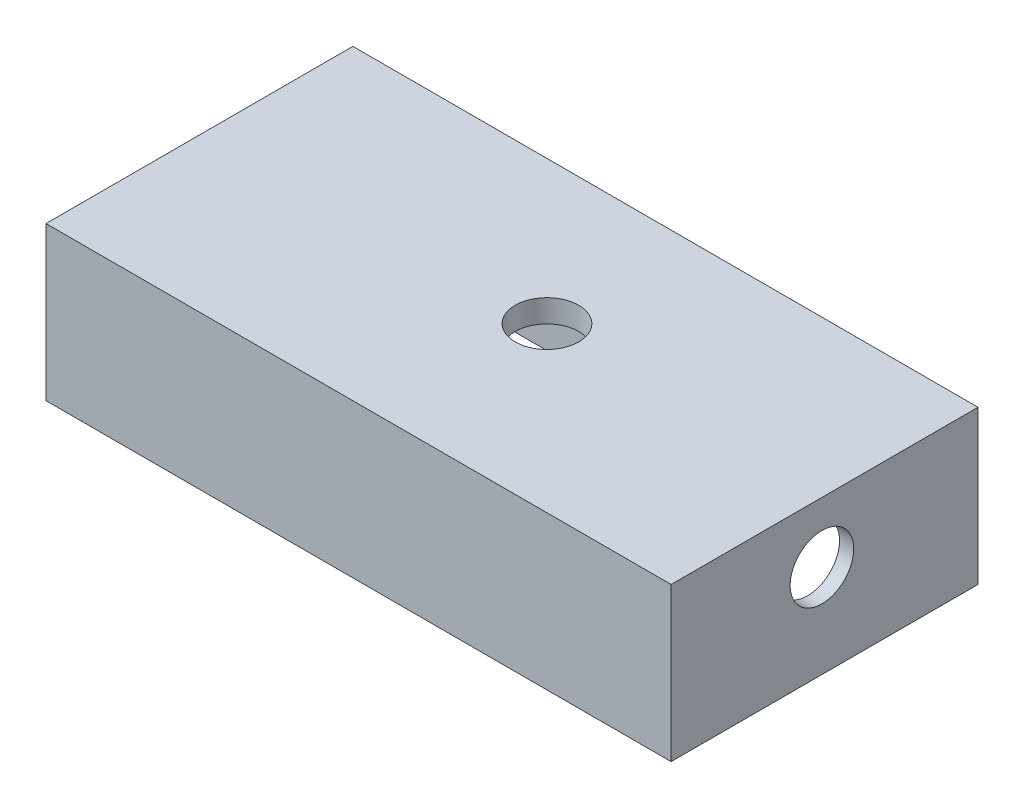
ISO-10303-21;
HEADER;
FILE_DESCRIPTION(('STEP AP214'),'2;1');
FILE_NAME('part.step','',(''),(''),'','','');
FILE_SCHEMA(('AUTOMOTIVE_DESIGN { 1 0 10303 214 1 1 1 1 }'));
ENDSEC;
DATA;
#1=APPLICATION_CONTEXT('core data for automotive mechanical design processes');
#2=APPLICATION_PROTOCOL_DEFINITION('international standard','automotive_design',2000,#1);
#3=PRODUCT_CONTEXT('',#1,'mechanical');
#4=PRODUCT('Part','Part','',(#3));
#5=PRODUCT_RELATED_PRODUCT_CATEGORY('part','',(#4));
#6=PRODUCT_DEFINITION_FORMATION('','',#4);
#7=PRODUCT_DEFINITION_CONTEXT('part definition',#1,'design');
#8=PRODUCT_DEFINITION('design','',#6,#7);
#9=PRODUCT_DEFINITION_SHAPE('','',#8);
#10=(LENGTH_UNIT() NAMED_UNIT(*) SI_UNIT(.MILLI.,.METRE.));
#11=(NAMED_UNIT(*) PLANE_ANGLE_UNIT() SI_UNIT($,.RADIAN.));
#12=(NAMED_UNIT(*) SI_UNIT($,.STERADIAN.) SOLID_ANGLE_UNIT());
#13=UNCERTAINTY_MEASURE_WITH_UNIT(LENGTH_MEASURE(1.E-05),#10,'distance_accuracy_value','');
#14=(GEOMETRIC_REPRESENTATION_CONTEXT(3) GLOBAL_UNCERTAINTY_ASSIGNED_CONTEXT((#13)) GLOBAL_UNIT_ASSIGNED_CONTEXT((#10,
#11,#12)) REPRESENTATION_CONTEXT('',''));
#15=CARTESIAN_POINT('',(0.,0.,0.));
#16=DIRECTION('',(0.,0.,1.));
#17=DIRECTION('',(1.,0.,0.));
#18=AXIS2_PLACEMENT_3D('',#15,#16,#17);
#19=CARTESIAN_POINT('',(174.625,85.725,85.725));
#20=DIRECTION('',(-1.,0.,0.));
#21=DIRECTION('',(0.,0.,1.));
#22=AXIS2_PLACEMENT_3D('',#19,#20,#21);
#23=PLANE('',#22);
#24=CARTESIAN_POINT('',(174.625,51.9726422641524,1.47611621049332));
#25=DIRECTION('',(1.,0.,0.));
#26=DIRECTION('',(0.,0.,-1.));
#27=AXIS2_PLACEMENT_3D('',#24,#25,#26);
#28=CIRCLE('',#27,17.7497380315211);
#29=CARTESIAN_POINT('',(174.625,51.9726422641524,-16.2736218210278));
#30=VERTEX_POINT('',#29);
#31=EDGE_CURVE('E265',#30,#30,#28,.T.);
#32=ORIENTED_EDGE('',*,*,#31,.F.);
#33=EDGE_LOOP('',(#32));
#34=FACE_BOUND('',#33,.T.);
#35=DIRECTION('',(0.,0.,-1.));
#36=VECTOR('',#35,1.);
#37=CARTESIAN_POINT('',(174.625,0.,85.725));
#38=LINE('',#37,#36);
#39=CARTESIAN_POINT('',(174.625,0.,85.725));
#40=VERTEX_POINT('',#39);
#41=CARTESIAN_POINT('',(174.625,0.,-85.725));
#42=VERTEX_POINT('',#41);
#43=EDGE_CURVE('E180',#40,#42,#38,.T.);
#44=ORIENTED_EDGE('',*,*,#43,.T.);
#45=DIRECTION('',(0.,-1.,0.));
#46=VECTOR('',#45,1.);
#47=CARTESIAN_POINT('',(174.625,85.725,-85.725));
#48=LINE('',#47,#46);
#49=CARTESIAN_POINT('',(174.625,85.725,-85.725));
#50=VERTEX_POINT('',#49);
#51=EDGE_CURVE('E212',#50,#42,#48,.T.);
#52=ORIENTED_EDGE('',*,*,#51,.F.);
#53=DIRECTION('',(0.,0.,-1.));
#54=VECTOR('',#53,1.);
#55=CARTESIAN_POINT('',(174.625,85.725,85.725));
#56=LINE('',#55,#54);
#57=CARTESIAN_POINT('',(174.625,85.725,85.725));
#58=VERTEX_POINT('',#57);
#59=EDGE_CURVE('E189',#58,#50,#56,.T.);
#60=ORIENTED_EDGE('',*,*,#59,.F.);
#61=DIRECTION('',(0.,-1.,0.));
#62=VECTOR('',#61,1.);
#63=CARTESIAN_POINT('',(174.625,85.725,85.725));
#64=LINE('',#63,#62);
#65=EDGE_CURVE('E198',#58,#40,#64,.T.);
#66=ORIENTED_EDGE('',*,*,#65,.T.);
#67=EDGE_LOOP('',(#44,#52,#60,#66));
#68=FACE_BOUND('',#67,.T.);
#69=ADVANCED_FACE('F42',(#34,#68),#23,.F.);
#70=CARTESIAN_POINT('',(-174.625,85.725,-85.725));
#71=DIRECTION('',(0.,0.,1.));
#72=DIRECTION('',(1.,0.,0.));
#73=AXIS2_PLACEMENT_3D('',#70,#71,#72);
#74=PLANE('',#73);
#75=DIRECTION('',(-1.,0.,0.));
#76=VECTOR('',#75,1.);
#77=CARTESIAN_POINT('',(-174.625,0.,-85.725));
#78=LINE('',#77,#76);
#79=CARTESIAN_POINT('',(-174.625,0.,-85.725));
#80=VERTEX_POINT('',#79);
#81=EDGE_CURVE('E183',#42,#80,#78,.T.);
#82=ORIENTED_EDGE('',*,*,#81,.T.);
#83=DIRECTION('',(0.,-1.,0.));
#84=VECTOR('',#83,1.);
#85=CARTESIAN_POINT('',(-174.625,85.725,-85.725));
#86=LINE('',#85,#84);
#87=CARTESIAN_POINT('',(-174.625,85.725,-85.725));
#88=VERTEX_POINT('',#87);
#89=EDGE_CURVE('E209',#88,#80,#86,.T.);
#90=ORIENTED_EDGE('',*,*,#89,.F.);
#91=DIRECTION('',(-1.,0.,0.));
#92=VECTOR('',#91,1.);
#93=CARTESIAN_POINT('',(-174.625,85.725,-85.725));
#94=LINE('',#93,#92);
#95=EDGE_CURVE('E192',#50,#88,#94,.T.);
#96=ORIENTED_EDGE('',*,*,#95,.F.);
#97=ORIENTED_EDGE('',*,*,#51,.T.);
#98=EDGE_LOOP('',(#82,#90,#96,#97));
#99=FACE_BOUND('',#98,.T.);
#100=ADVANCED_FACE('F374',(#99),#74,.F.);
#101=CARTESIAN_POINT('',(-174.625,85.725,85.725));
#102=DIRECTION('',(1.,0.,0.));
#103=DIRECTION('',(0.,0.,-1.));
#104=AXIS2_PLACEMENT_3D('',#101,#102,#103);
#105=PLANE('',#104);
#106=DIRECTION('',(0.,0.,1.));
#107=VECTOR('',#106,1.);
#108=CARTESIAN_POINT('',(-174.625,0.,85.725));
#109=LINE('',#108,#107);
#110=CARTESIAN_POINT('',(-174.625,0.,85.725));
#111=VERTEX_POINT('',#110);
#112=EDGE_CURVE('E201',#80,#111,#109,.T.);
#113=ORIENTED_EDGE('',*,*,#112,.T.);
#114=DIRECTION('',(0.,-1.,0.));
#115=VECTOR('',#114,1.);
#116=CARTESIAN_POINT('',(-174.625,85.725,85.725));
#117=LINE('',#116,#115);
#118=CARTESIAN_POINT('',(-174.625,85.725,85.725));
#119=VERTEX_POINT('',#118);
#120=EDGE_CURVE('E206',#119,#111,#117,.T.);
#121=ORIENTED_EDGE('',*,*,#120,.F.);
#122=DIRECTION('',(0.,0.,1.));
#123=VECTOR('',#122,1.);
#124=CARTESIAN_POINT('',(-174.625,85.725,85.725));
#125=LINE('',#124,#123);
#126=EDGE_CURVE('E195',#88,#119,#125,.T.);
#127=ORIENTED_EDGE('',*,*,#126,.F.);
#128=ORIENTED_EDGE('',*,*,#89,.T.);
#129=EDGE_LOOP('',(#113,#121,#127,#128));
#130=FACE_BOUND('',#129,.T.);
#131=ADVANCED_FACE('F371',(#130),#105,.F.);
#132=CARTESIAN_POINT('',(-174.625,85.725,85.725));
#133=DIRECTION('',(0.,0.,-1.));
#134=DIRECTION('',(-1.,0.,0.));
#135=AXIS2_PLACEMENT_3D('',#132,#133,#134);
#136=PLANE('',#135);
#137=DIRECTION('',(1.,0.,0.));
#138=VECTOR('',#137,1.);
#139=CARTESIAN_POINT('',(-174.625,0.,85.725));
#140=LINE('',#139,#138);
#141=EDGE_CURVE('E193',#111,#40,#140,.T.);
#142=ORIENTED_EDGE('',*,*,#141,.T.);
#143=ORIENTED_EDGE('',*,*,#65,.F.);
#144=DIRECTION('',(1.,0.,0.));
#145=VECTOR('',#144,1.);
#146=CARTESIAN_POINT('',(-174.625,85.725,85.725));
#147=LINE('',#146,#145);
#148=EDGE_CURVE('E197',#119,#58,#147,.T.);
#149=ORIENTED_EDGE('',*,*,#148,.F.);
#150=ORIENTED_EDGE('',*,*,#120,.T.);
#151=EDGE_LOOP('',(#142,#143,#149,#150));
#152=FACE_BOUND('',#151,.T.);
#153=ADVANCED_FACE('F367',(#152),#136,.F.);
#154=CARTESIAN_POINT('',(0.,85.725,0.));
#155=DIRECTION('',(0.,-1.,0.));
#156=DIRECTION('',(0.,0.,-1.));
#157=AXIS2_PLACEMENT_3D('',#154,#155,#156);
#158=PLANE('',#157);
#159=CARTESIAN_POINT('',(13.7243336570027,85.725,-5.81118092938393));
#160=DIRECTION('',(0.,1.,0.));
#161=DIRECTION('',(0.,0.,1.));
#162=AXIS2_PLACEMENT_3D('',#159,#160,#161);
#163=CIRCLE('',#162,17.7497380315211);
#164=CARTESIAN_POINT('',(13.7243336570027,85.725,11.9385571021372));
#165=VERTEX_POINT('',#164);
#166=EDGE_CURVE('E279',#165,#165,#163,.T.);
#167=ORIENTED_EDGE('',*,*,#166,.F.);
#168=EDGE_LOOP('',(#167));
#169=FACE_BOUND('',#168,.T.);
#170=ORIENTED_EDGE('',*,*,#59,.T.);
#171=ORIENTED_EDGE('',*,*,#95,.T.);
#172=ORIENTED_EDGE('',*,*,#126,.T.);
#173=ORIENTED_EDGE('',*,*,#148,.T.);
#174=EDGE_LOOP('',(#170,#171,#172,#173));
#175=FACE_BOUND('',#174,.T.);
#176=ADVANCED_FACE('F356',(#169,#175),#158,.F.);
#177=CARTESIAN_POINT('',(0.,0.,0.));
#178=DIRECTION('',(0.,-1.,0.));
#179=DIRECTION('',(0.,0.,-1.));
#180=AXIS2_PLACEMENT_3D('',#177,#178,#179);
#181=PLANE('',#180);
#182=DIRECTION('',(0.,0.,-1.));
#183=VECTOR('',#182,1.);
#184=CARTESIAN_POINT('',(167.362138829114,0.,-54.2665353281136));
#185=LINE('',#184,#183);
#186=CARTESIAN_POINT('',(167.362138829114,0.,54.2665353281136));
#187=VERTEX_POINT('',#186);
#188=CARTESIAN_POINT('',(167.362138829114,0.,-54.2665353281136));
#189=VERTEX_POINT('',#188);
#190=EDGE_CURVE('E227',#187,#189,#185,.T.);
#191=ORIENTED_EDGE('',*,*,#190,.T.);
#192=CARTESIAN_POINT('',(143.166535328114,0.,-54.2665353281136));
#193=DIRECTION('',(0.,-1.,0.));
#194=DIRECTION('',(0.,0.,-1.));
#195=AXIS2_PLACEMENT_3D('',#192,#193,#194);
#196=CIRCLE('',#195,24.195603501);
#197=CARTESIAN_POINT('',(143.166535328114,0.,-78.4621388291135));
#198=VERTEX_POINT('',#197);
#199=EDGE_CURVE('E229',#189,#198,#196,.F.);
#200=ORIENTED_EDGE('',*,*,#199,.T.);
#201=DIRECTION('',(-1.,0.,0.));
#202=VECTOR('',#201,1.);
#203=CARTESIAN_POINT('',(-143.166535328114,0.,-78.4621388291135));
#204=LINE('',#203,#202);
#205=CARTESIAN_POINT('',(-143.166535328114,0.,-78.4621388291135));
#206=VERTEX_POINT('',#205);
#207=EDGE_CURVE('E219',#198,#206,#204,.T.);
#208=ORIENTED_EDGE('',*,*,#207,.T.);
#209=CARTESIAN_POINT('',(-143.166535328114,0.,-54.2665353281136));
#210=DIRECTION('',(0.,-1.,0.));
#211=DIRECTION('',(0.,0.,-1.));
#212=AXIS2_PLACEMENT_3D('',#209,#210,#211);
#213=CIRCLE('',#212,24.1956035009999);
#214=CARTESIAN_POINT('',(-167.362138829114,0.,-54.2665353281136));
#215=VERTEX_POINT('',#214);
#216=EDGE_CURVE('E215',#206,#215,#213,.F.);
#217=ORIENTED_EDGE('',*,*,#216,.T.);
#218=DIRECTION('',(0.,0.,1.));
#219=VECTOR('',#218,1.);
#220=CARTESIAN_POINT('',(-167.362138829114,0.,54.2665353281136));
#221=LINE('',#220,#219);
#222=CARTESIAN_POINT('',(-167.362138829114,0.,54.2665353281136));
#223=VERTEX_POINT('',#222);
#224=EDGE_CURVE('E217',#215,#223,#221,.T.);
#225=ORIENTED_EDGE('',*,*,#224,.T.);
#226=CARTESIAN_POINT('',(-143.166535328114,0.,54.2665353281136));
#227=DIRECTION('',(0.,-1.,0.));
#228=DIRECTION('',(0.,0.,-1.));
#229=AXIS2_PLACEMENT_3D('',#226,#227,#228);
#230=CIRCLE('',#229,24.195603501);
#231=CARTESIAN_POINT('',(-143.166535328114,0.,78.4621388291135));
#232=VERTEX_POINT('',#231);
#233=EDGE_CURVE('E221',#223,#232,#230,.F.);
#234=ORIENTED_EDGE('',*,*,#233,.T.);
#235=DIRECTION('',(1.,0.,0.));
#236=VECTOR('',#235,1.);
#237=CARTESIAN_POINT('',(143.166535328114,0.,78.4621388291135));
#238=LINE('',#237,#236);
#239=CARTESIAN_POINT('',(143.166535328114,0.,78.4621388291135));
#240=VERTEX_POINT('',#239);
#241=EDGE_CURVE('E223',#232,#240,#238,.T.);
#242=ORIENTED_EDGE('',*,*,#241,.T.);
#243=CARTESIAN_POINT('',(143.166535328114,0.,54.2665353281136));
#244=DIRECTION('',(0.,-1.,0.));
#245=DIRECTION('',(0.,0.,-1.));
#246=AXIS2_PLACEMENT_3D('',#243,#244,#245);
#247=CIRCLE('',#246,24.1956035009999);
#248=EDGE_CURVE('E225',#240,#187,#247,.F.);
#249=ORIENTED_EDGE('',*,*,#248,.T.);
#250=EDGE_LOOP('',(#191,#200,#208,#217,#225,#234,#242,#249));
#251=FACE_BOUND('',#250,.T.);
#252=ORIENTED_EDGE('',*,*,#43,.F.);
#253=ORIENTED_EDGE('',*,*,#141,.F.);
#254=ORIENTED_EDGE('',*,*,#112,.F.);
#255=ORIENTED_EDGE('',*,*,#81,.F.);
#256=EDGE_LOOP('',(#252,#253,#254,#255));
#257=FACE_BOUND('',#256,.T.);
#258=ADVANCED_FACE('F353',(#251,#257),#181,.T.);
#259=CARTESIAN_POINT('',(143.166535328114,453.719578006082,77.8271388291136));
#260=DIRECTION('',(0.,0.,1.));
#261=DIRECTION('',(1.,0.,0.));
#262=AXIS2_PLACEMENT_3D('',#259,#260,#261);
#263=PLANE('',#262);
#264=DIRECTION('',(0.,-1.,0.));
#265=VECTOR('',#264,1.);
#266=CARTESIAN_POINT('',(143.166535328114,453.719578006082,77.8271388291136));
#267=LINE('',#266,#265);
#268=CARTESIAN_POINT('',(143.166535328114,73.025,77.8271388291136));
#269=VERTEX_POINT('',#268);
#270=CARTESIAN_POINT('',(143.166535328114,0.634999999999997,77.8271388291136));
#271=VERTEX_POINT('',#270);
#272=EDGE_CURVE('E165',#269,#271,#267,.T.);
#273=ORIENTED_EDGE('',*,*,#272,.T.);
#274=DIRECTION('',(-1.,0.,0.));
#275=VECTOR('',#274,1.);
#276=CARTESIAN_POINT('',(-143.166535328114,0.634999999999997,77.8271388291136));
#277=LINE('',#276,#275);
#278=CARTESIAN_POINT('',(-143.166535328114,0.634999999999997,77.8271388291136));
#279=VERTEX_POINT('',#278);
#280=EDGE_CURVE('E239',#271,#279,#277,.T.);
#281=ORIENTED_EDGE('',*,*,#280,.T.);
#282=DIRECTION('',(0.,-1.,0.));
#283=VECTOR('',#282,1.);
#284=CARTESIAN_POINT('',(-143.166535328114,453.719578006082,77.8271388291136));
#285=LINE('',#284,#283);
#286=CARTESIAN_POINT('',(-143.166535328114,73.025,77.8271388291136));
#287=VERTEX_POINT('',#286);
#288=EDGE_CURVE('E174',#287,#279,#285,.T.);
#289=ORIENTED_EDGE('',*,*,#288,.F.);
#290=DIRECTION('',(1.,0.,0.));
#291=VECTOR('',#290,1.);
#292=CARTESIAN_POINT('',(143.166535328114,73.025,77.8271388291136));
#293=LINE('',#292,#291);
#294=EDGE_CURVE('E178',#287,#269,#293,.T.);
#295=ORIENTED_EDGE('',*,*,#294,.T.);
#296=EDGE_LOOP('',(#273,#281,#289,#295));
#297=FACE_BOUND('',#296,.T.);
#298=ADVANCED_FACE('F349',(#297),#263,.F.);
#299=CARTESIAN_POINT('',(143.166535328114,453.719578006082,54.2665353281136));
#300=DIRECTION('',(0.,-1.,0.));
#301=DIRECTION('',(0.,0.,-1.));
#302=AXIS2_PLACEMENT_3D('',#299,#300,#301);
#303=CYLINDRICAL_SURFACE('',#302,23.560603501);
#304=DIRECTION('',(0.,-1.,0.));
#305=VECTOR('',#304,1.);
#306=CARTESIAN_POINT('',(166.727138829114,453.719578006082,54.2665353281136));
#307=LINE('',#306,#305);
#308=CARTESIAN_POINT('',(166.727138829114,73.025,54.2665353281136));
#309=VERTEX_POINT('',#308);
#310=CARTESIAN_POINT('',(166.727138829114,0.634999999999997,54.2665353281136));
#311=VERTEX_POINT('',#310);
#312=EDGE_CURVE('E295',#309,#311,#307,.T.);
#313=ORIENTED_EDGE('',*,*,#312,.T.);
#314=CARTESIAN_POINT('',(143.166535328114,0.634999999999997,54.2665353281136));
#315=DIRECTION('',(0.,-1.,0.));
#316=DIRECTION('',(0.,0.,-1.));
#317=AXIS2_PLACEMENT_3D('',#314,#315,#316);
#318=CIRCLE('',#317,23.560603501);
#319=EDGE_CURVE('E237',#311,#271,#318,.T.);
#320=ORIENTED_EDGE('',*,*,#319,.T.);
#321=ORIENTED_EDGE('',*,*,#272,.F.);
#322=CARTESIAN_POINT('',(143.166535328114,73.025,54.2665353281136));
#323=DIRECTION('',(0.,-1.,0.));
#324=DIRECTION('',(0.,0.,-1.));
#325=AXIS2_PLACEMENT_3D('',#322,#323,#324);
#326=CIRCLE('',#325,23.560603501);
#327=EDGE_CURVE('E185',#309,#269,#326,.T.);
#328=ORIENTED_EDGE('',*,*,#327,.F.);
#329=EDGE_LOOP('',(#313,#320,#321,#328));
#330=FACE_BOUND('',#329,.T.);
#331=ADVANCED_FACE('F340',(#330),#303,.F.);
#332=CARTESIAN_POINT('',(166.727138829114,453.719578006082,-54.2665353281136));
#333=DIRECTION('',(1.,0.,0.));
#334=DIRECTION('',(0.,0.,-1.));
#335=AXIS2_PLACEMENT_3D('',#332,#333,#334);
#336=PLANE('',#335);
#337=CARTESIAN_POINT('',(166.727138829114,51.9726422641524,1.47611621049332));
#338=DIRECTION('',(1.,0.,0.));
#339=DIRECTION('',(0.,0.,-1.));
#340=AXIS2_PLACEMENT_3D('',#337,#338,#339);
#341=CIRCLE('',#340,17.7497380315211);
#342=CARTESIAN_POINT('',(166.727138829114,51.9726422641524,-16.2736218210278));
#343=VERTEX_POINT('',#342);
#344=EDGE_CURVE('E271',#343,#343,#341,.F.);
#345=ORIENTED_EDGE('',*,*,#344,.F.);
#346=EDGE_LOOP('',(#345));
#347=FACE_BOUND('',#346,.T.);
#348=DIRECTION('',(0.,-1.,0.));
#349=VECTOR('',#348,1.);
#350=CARTESIAN_POINT('',(166.727138829114,453.719578006082,-54.2665353281136));
#351=LINE('',#350,#349);
#352=CARTESIAN_POINT('',(166.727138829114,73.025,-54.2665353281136));
#353=VERTEX_POINT('',#352);
#354=CARTESIAN_POINT('',(166.727138829114,0.634999999999997,-54.2665353281136));
#355=VERTEX_POINT('',#354);
#356=EDGE_CURVE('E298',#353,#355,#351,.T.);
#357=ORIENTED_EDGE('',*,*,#356,.T.);
#358=DIRECTION('',(0.,0.,1.));
#359=VECTOR('',#358,1.);
#360=CARTESIAN_POINT('',(166.727138829114,0.634999999999997,54.2665353281136));
#361=LINE('',#360,#359);
#362=EDGE_CURVE('E235',#355,#311,#361,.T.);
#363=ORIENTED_EDGE('',*,*,#362,.T.);
#364=ORIENTED_EDGE('',*,*,#312,.F.);
#365=DIRECTION('',(0.,0.,-1.));
#366=VECTOR('',#365,1.);
#367=CARTESIAN_POINT('',(166.727138829114,73.025,-54.2665353281136));
#368=LINE('',#367,#366);
#369=EDGE_CURVE('E290',#309,#353,#368,.T.);
#370=ORIENTED_EDGE('',*,*,#369,.T.);
#371=EDGE_LOOP('',(#357,#363,#364,#370));
#372=FACE_BOUND('',#371,.T.);
#373=ADVANCED_FACE('F337',(#347,#372),#336,.F.);
#374=CARTESIAN_POINT('',(143.166535328114,453.719578006082,-54.2665353281136));
#375=DIRECTION('',(0.,-1.,0.));
#376=DIRECTION('',(0.,0.,-1.));
#377=AXIS2_PLACEMENT_3D('',#374,#375,#376);
#378=CYLINDRICAL_SURFACE('',#377,23.560603501);
#379=DIRECTION('',(0.,-1.,0.));
#380=VECTOR('',#379,1.);
#381=CARTESIAN_POINT('',(143.166535328114,453.719578006082,-77.8271388291136));
#382=LINE('',#381,#380);
#383=CARTESIAN_POINT('',(143.166535328114,73.025,-77.8271388291136));
#384=VERTEX_POINT('',#383);
#385=CARTESIAN_POINT('',(143.166535328114,0.634999999999997,-77.8271388291136));
#386=VERTEX_POINT('',#385);
#387=EDGE_CURVE('E301',#384,#386,#382,.T.);
#388=ORIENTED_EDGE('',*,*,#387,.T.);
#389=CARTESIAN_POINT('',(143.166535328114,0.634999999999997,-54.2665353281136));
#390=DIRECTION('',(0.,-1.,0.));
#391=DIRECTION('',(0.,0.,-1.));
#392=AXIS2_PLACEMENT_3D('',#389,#390,#391);
#393=CIRCLE('',#392,23.560603501);
#394=EDGE_CURVE('E232',#386,#355,#393,.T.);
#395=ORIENTED_EDGE('',*,*,#394,.T.);
#396=ORIENTED_EDGE('',*,*,#356,.F.);
#397=CARTESIAN_POINT('',(143.166535328114,73.025,-54.2665353281136));
#398=DIRECTION('',(0.,-1.,0.));
#399=DIRECTION('',(0.,0.,-1.));
#400=AXIS2_PLACEMENT_3D('',#397,#398,#399);
#401=CIRCLE('',#400,23.560603501);
#402=EDGE_CURVE('E287',#384,#353,#401,.T.);
#403=ORIENTED_EDGE('',*,*,#402,.F.);
#404=EDGE_LOOP('',(#388,#395,#396,#403));
#405=FACE_BOUND('',#404,.T.);
#406=ADVANCED_FACE('F323',(#405),#378,.F.);
#407=CARTESIAN_POINT('',(-143.166535328114,453.719578006082,-77.8271388291136));
#408=DIRECTION('',(0.,0.,-1.));
#409=DIRECTION('',(-1.,0.,0.));
#410=AXIS2_PLACEMENT_3D('',#407,#408,#409);
#411=PLANE('',#410);
#412=DIRECTION('',(0.,-1.,0.));
#413=VECTOR('',#412,1.);
#414=CARTESIAN_POINT('',(-143.166535328114,453.719578006082,-77.8271388291136));
#415=LINE('',#414,#413);
#416=CARTESIAN_POINT('',(-143.166535328114,73.025,-77.8271388291136));
#417=VERTEX_POINT('',#416);
#418=CARTESIAN_POINT('',(-143.166535328114,0.634999999999997,-77.8271388291136));
#419=VERTEX_POINT('',#418);
#420=EDGE_CURVE('E304',#417,#419,#415,.T.);
#421=ORIENTED_EDGE('',*,*,#420,.T.);
#422=DIRECTION('',(1.,0.,0.));
#423=VECTOR('',#422,1.);
#424=CARTESIAN_POINT('',(143.166535328114,0.634999999999997,-77.8271388291136));
#425=LINE('',#424,#423);
#426=EDGE_CURVE('E242',#419,#386,#425,.T.);
#427=ORIENTED_EDGE('',*,*,#426,.T.);
#428=ORIENTED_EDGE('',*,*,#387,.F.);
#429=DIRECTION('',(-1.,0.,0.));
#430=VECTOR('',#429,1.);
#431=CARTESIAN_POINT('',(-143.166535328114,73.025,-77.8271388291136));
#432=LINE('',#431,#430);
#433=EDGE_CURVE('E285',#384,#417,#432,.T.);
#434=ORIENTED_EDGE('',*,*,#433,.T.);
#435=EDGE_LOOP('',(#421,#427,#428,#434));
#436=FACE_BOUND('',#435,.T.);
#437=ADVANCED_FACE('F320',(#436),#411,.F.);
#438=CARTESIAN_POINT('',(-143.166535328114,453.719578006082,-54.2665353281136));
#439=DIRECTION('',(0.,-1.,0.));
#440=DIRECTION('',(0.,0.,-1.));
#441=AXIS2_PLACEMENT_3D('',#438,#439,#440);
#442=CYLINDRICAL_SURFACE('',#441,23.560603501);
#443=DIRECTION('',(0.,-1.,0.));
#444=VECTOR('',#443,1.);
#445=CARTESIAN_POINT('',(-166.727138829114,453.719578006082,-54.2665353281136));
#446=LINE('',#445,#444);
#447=CARTESIAN_POINT('',(-166.727138829114,73.025,-54.2665353281136));
#448=VERTEX_POINT('',#447);
#449=CARTESIAN_POINT('',(-166.727138829114,0.634999999999997,-54.2665353281136));
#450=VERTEX_POINT('',#449);
#451=EDGE_CURVE('E160',#448,#450,#446,.T.);
#452=ORIENTED_EDGE('',*,*,#451,.T.);
#453=CARTESIAN_POINT('',(-143.166535328114,0.634999999999997,-54.2665353281136));
#454=DIRECTION('',(0.,-1.,0.));
#455=DIRECTION('',(0.,0.,-1.));
#456=AXIS2_PLACEMENT_3D('',#453,#454,#455);
#457=CIRCLE('',#456,23.560603501);
#458=EDGE_CURVE('E12',#450,#419,#457,.T.);
#459=ORIENTED_EDGE('',*,*,#458,.T.);
#460=ORIENTED_EDGE('',*,*,#420,.F.);
#461=CARTESIAN_POINT('',(-143.166535328114,73.025,-54.2665353281136));
#462=DIRECTION('',(0.,-1.,0.));
#463=DIRECTION('',(0.,0.,-1.));
#464=AXIS2_PLACEMENT_3D('',#461,#462,#463);
#465=CIRCLE('',#464,23.560603501);
#466=EDGE_CURVE('E164',#448,#417,#465,.T.);
#467=ORIENTED_EDGE('',*,*,#466,.F.);
#468=EDGE_LOOP('',(#452,#459,#460,#467));
#469=FACE_BOUND('',#468,.T.);
#470=ADVANCED_FACE('F307',(#469),#442,.F.);
#471=CARTESIAN_POINT('',(-166.727138829114,453.719578006082,54.2665353281136));
#472=DIRECTION('',(-1.,0.,0.));
#473=DIRECTION('',(0.,0.,1.));
#474=AXIS2_PLACEMENT_3D('',#471,#472,#473);
#475=PLANE('',#474);
#476=DIRECTION('',(0.,-1.,0.));
#477=VECTOR('',#476,1.);
#478=CARTESIAN_POINT('',(-166.727138829114,453.719578006082,54.2665353281136));
#479=LINE('',#478,#477);
#480=CARTESIAN_POINT('',(-166.727138829114,73.025,54.2665353281136));
#481=VERTEX_POINT('',#480);
#482=CARTESIAN_POINT('',(-166.727138829114,0.634999999999997,54.2665353281136));
#483=VERTEX_POINT('',#482);
#484=EDGE_CURVE('E158',#481,#483,#479,.T.);
#485=ORIENTED_EDGE('',*,*,#484,.T.);
#486=DIRECTION('',(0.,0.,-1.));
#487=VECTOR('',#486,1.);
#488=CARTESIAN_POINT('',(-166.727138829114,0.634999999999997,-54.2665353281136));
#489=LINE('',#488,#487);
#490=EDGE_CURVE('E51',#483,#450,#489,.T.);
#491=ORIENTED_EDGE('',*,*,#490,.T.);
#492=ORIENTED_EDGE('',*,*,#451,.F.);
#493=DIRECTION('',(0.,0.,1.));
#494=VECTOR('',#493,1.);
#495=CARTESIAN_POINT('',(-166.727138829114,73.025,54.2665353281136));
#496=LINE('',#495,#494);
#497=EDGE_CURVE('E155',#448,#481,#496,.T.);
#498=ORIENTED_EDGE('',*,*,#497,.T.);
#499=EDGE_LOOP('',(#485,#491,#492,#498));
#500=FACE_BOUND('',#499,.T.);
#501=ADVANCED_FACE('F157',(#500),#475,.F.);
#502=CARTESIAN_POINT('',(-143.166535328114,453.719578006082,54.2665353281136));
#503=DIRECTION('',(0.,-1.,0.));
#504=DIRECTION('',(0.,0.,-1.));
#505=AXIS2_PLACEMENT_3D('',#502,#503,#504);
#506=CYLINDRICAL_SURFACE('',#505,23.560603501);
#507=ORIENTED_EDGE('',*,*,#288,.T.);
#508=CARTESIAN_POINT('',(-143.166535328114,0.634999999999997,54.2665353281136));
#509=DIRECTION('',(0.,-1.,0.));
#510=DIRECTION('',(0.,0.,-1.));
#511=AXIS2_PLACEMENT_3D('',#508,#509,#510);
#512=CIRCLE('',#511,23.560603501);
#513=EDGE_CURVE('E173',#279,#483,#512,.T.);
#514=ORIENTED_EDGE('',*,*,#513,.T.);
#515=ORIENTED_EDGE('',*,*,#484,.F.);
#516=CARTESIAN_POINT('',(-143.166535328114,73.025,54.2665353281136));
#517=DIRECTION('',(0.,-1.,0.));
#518=DIRECTION('',(0.,0.,-1.));
#519=AXIS2_PLACEMENT_3D('',#516,#517,#518);
#520=CIRCLE('',#519,23.560603501);
#521=EDGE_CURVE('E170',#481,#287,#520,.F.);
#522=ORIENTED_EDGE('',*,*,#521,.T.);
#523=EDGE_LOOP('',(#507,#514,#515,#522));
#524=FACE_BOUND('',#523,.T.);
#525=ADVANCED_FACE('F169',(#524),#506,.F.);
#526=CARTESIAN_POINT('',(0.,73.025,0.));
#527=DIRECTION('',(0.,-1.,0.));
#528=DIRECTION('',(0.,0.,-1.));
#529=AXIS2_PLACEMENT_3D('',#526,#527,#528);
#530=PLANE('',#529);
#531=CARTESIAN_POINT('',(13.7243336570027,73.025,-5.81118092938393));
#532=DIRECTION('',(0.,-1.,0.));
#533=DIRECTION('',(0.,0.,-1.));
#534=AXIS2_PLACEMENT_3D('',#531,#532,#533);
#535=CIRCLE('',#534,17.7497380315211);
#536=CARTESIAN_POINT('',(13.7243336570027,73.025,-23.5609189609051));
#537=VERTEX_POINT('',#536);
#538=EDGE_CURVE('E276',#537,#537,#535,.F.);
#539=ORIENTED_EDGE('',*,*,#538,.T.);
#540=EDGE_LOOP('',(#539));
#541=FACE_BOUND('',#540,.T.);
#542=ORIENTED_EDGE('',*,*,#294,.F.);
#543=ORIENTED_EDGE('',*,*,#521,.F.);
#544=ORIENTED_EDGE('',*,*,#497,.F.);
#545=ORIENTED_EDGE('',*,*,#466,.T.);
#546=ORIENTED_EDGE('',*,*,#433,.F.);
#547=ORIENTED_EDGE('',*,*,#402,.T.);
#548=ORIENTED_EDGE('',*,*,#369,.F.);
#549=ORIENTED_EDGE('',*,*,#327,.T.);
#550=EDGE_LOOP('',(#542,#543,#544,#545,#546,#547,#548,#549));
#551=FACE_BOUND('',#550,.T.);
#552=ADVANCED_FACE('F176',(#541,#551),#530,.T.);
#553=CARTESIAN_POINT('',(13.7243336570027,-0.001000000000001,-5.81118092938393));
#554=DIRECTION('',(0.,1.,0.));
#555=DIRECTION('',(0.,0.,1.));
#556=AXIS2_PLACEMENT_3D('',#553,#554,#555);
#557=CYLINDRICAL_SURFACE('',#556,17.7497380315211);
#558=ORIENTED_EDGE('',*,*,#538,.F.);
#559=EDGE_LOOP('',(#558));
#560=FACE_BOUND('',#559,.T.);
#561=ORIENTED_EDGE('',*,*,#166,.T.);
#562=EDGE_LOOP('',(#561));
#563=FACE_BOUND('',#562,.T.);
#564=ADVANCED_FACE('F413',(#560,#563),#557,.F.);
#565=CARTESIAN_POINT('',(-174.626,51.9726422641524,1.47611621049332));
#566=DIRECTION('',(1.,0.,0.));
#567=DIRECTION('',(0.,0.,-1.));
#568=AXIS2_PLACEMENT_3D('',#565,#566,#567);
#569=CYLINDRICAL_SURFACE('',#568,17.7497380315211);
#570=ORIENTED_EDGE('',*,*,#31,.T.);
#571=EDGE_LOOP('',(#570));
#572=FACE_BOUND('',#571,.T.);
#573=ORIENTED_EDGE('',*,*,#344,.T.);
#574=EDGE_LOOP('',(#573));
#575=FACE_BOUND('',#574,.T.);
#576=ADVANCED_FACE('F409',(#572,#575),#569,.F.);
#577=CARTESIAN_POINT('',(-143.166535328114,0.634999999999997,54.2665353281136));
#578=DIRECTION('',(0.,-1.,0.));
#579=DIRECTION('',(0.,0.,-1.));
#580=AXIS2_PLACEMENT_3D('',#577,#578,#579);
#581=CONICAL_SURFACE('',#580,23.560603501,0.785398163397413);
#582=DIRECTION('',(-0.707106781186517,-0.707106781186578,0.));
#583=VECTOR('',#582,1.);
#584=CARTESIAN_POINT('',(-166.727138829114,0.634999999999997,54.2665353281136));
#585=LINE('',#584,#583);
#586=EDGE_CURVE('E260',#483,#223,#585,.T.);
#587=ORIENTED_EDGE('',*,*,#586,.F.);
#588=ORIENTED_EDGE('',*,*,#513,.F.);
#589=DIRECTION('',(0.,0.707106781186571,-0.707106781186524));
#590=VECTOR('',#589,1.);
#591=CARTESIAN_POINT('',(-143.166535328114,0.,78.4621388291135));
#592=LINE('',#591,#590);
#593=EDGE_CURVE('E46',#232,#279,#592,.T.);
#594=ORIENTED_EDGE('',*,*,#593,.F.);
#595=ORIENTED_EDGE('',*,*,#233,.F.);
#596=EDGE_LOOP('',(#587,#588,#594,#595));
#597=FACE_BOUND('',#596,.T.);
#598=ADVANCED_FACE('F44',(#597),#581,.F.);
#599=CARTESIAN_POINT('',(143.166535328114,0.634999999999997,77.8271388291136));
#600=DIRECTION('',(0.,-0.707106781186524,-0.707106781186571));
#601=DIRECTION('',(1.,0.,0.));
#602=AXIS2_PLACEMENT_3D('',#599,#600,#601);
#603=PLANE('',#602);
#604=ORIENTED_EDGE('',*,*,#593,.T.);
#605=ORIENTED_EDGE('',*,*,#280,.F.);
#606=DIRECTION('',(0.,0.707106781186571,-0.707106781186524));
#607=VECTOR('',#606,1.);
#608=CARTESIAN_POINT('',(143.166535328114,0.,78.4621388291135));
#609=LINE('',#608,#607);
#610=EDGE_CURVE('E258',#240,#271,#609,.T.);
#611=ORIENTED_EDGE('',*,*,#610,.F.);
#612=ORIENTED_EDGE('',*,*,#241,.F.);
#613=EDGE_LOOP('',(#604,#605,#611,#612));
#614=FACE_BOUND('',#613,.T.);
#615=ADVANCED_FACE('F347',(#614),#603,.T.);
#616=CARTESIAN_POINT('',(-166.727138829114,0.634999999999997,54.2665353281136));
#617=DIRECTION('',(0.707106781186578,-0.707106781186517,0.));
#618=DIRECTION('',(0.,0.,1.));
#619=AXIS2_PLACEMENT_3D('',#616,#617,#618);
#620=PLANE('',#619);
#621=ORIENTED_EDGE('',*,*,#586,.T.);
#622=ORIENTED_EDGE('',*,*,#224,.F.);
#623=DIRECTION('',(-0.707106781186517,-0.707106781186578,0.));
#624=VECTOR('',#623,1.);
#625=CARTESIAN_POINT('',(-166.727138829114,0.634999999999997,-54.2665353281136));
#626=LINE('',#625,#624);
#627=EDGE_CURVE('E255',#450,#215,#626,.T.);
#628=ORIENTED_EDGE('',*,*,#627,.F.);
#629=ORIENTED_EDGE('',*,*,#490,.F.);
#630=EDGE_LOOP('',(#621,#622,#628,#629));
#631=FACE_BOUND('',#630,.T.);
#632=ADVANCED_FACE('F308',(#631),#620,.T.);
#633=CARTESIAN_POINT('',(143.166535328114,0.,54.2665353281136));
#634=DIRECTION('',(0.,-1.,0.));
#635=DIRECTION('',(0.,0.,-1.));
#636=AXIS2_PLACEMENT_3D('',#633,#634,#635);
#637=CONICAL_SURFACE('',#636,24.1956035009999,0.785398163397407);
#638=ORIENTED_EDGE('',*,*,#610,.T.);
#639=ORIENTED_EDGE('',*,*,#319,.F.);
#640=DIRECTION('',(-0.707106781186517,0.707106781186578,0.));
#641=VECTOR('',#640,1.);
#642=CARTESIAN_POINT('',(167.362138829114,0.,54.2665353281136));
#643=LINE('',#642,#641);
#644=EDGE_CURVE('E252',#187,#311,#643,.T.);
#645=ORIENTED_EDGE('',*,*,#644,.F.);
#646=ORIENTED_EDGE('',*,*,#248,.F.);
#647=EDGE_LOOP('',(#638,#639,#645,#646));
#648=FACE_BOUND('',#647,.T.);
#649=ADVANCED_FACE('F344',(#648),#637,.F.);
#650=CARTESIAN_POINT('',(-143.166535328114,0.,-54.2665353281136));
#651=DIRECTION('',(0.,-1.,0.));
#652=DIRECTION('',(0.,0.,-1.));
#653=AXIS2_PLACEMENT_3D('',#650,#651,#652);
#654=CONICAL_SURFACE('',#653,24.1956035009999,0.785398163397407);
#655=ORIENTED_EDGE('',*,*,#627,.T.);
#656=ORIENTED_EDGE('',*,*,#216,.F.);
#657=DIRECTION('',(0.,-0.707106781186578,-0.707106781186517));
#658=VECTOR('',#657,1.);
#659=CARTESIAN_POINT('',(-143.166535328114,0.634999999999997,-77.8271388291136));
#660=LINE('',#659,#658);
#661=EDGE_CURVE('E249',#419,#206,#660,.T.);
#662=ORIENTED_EDGE('',*,*,#661,.F.);
#663=ORIENTED_EDGE('',*,*,#458,.F.);
#664=EDGE_LOOP('',(#655,#656,#662,#663));
#665=FACE_BOUND('',#664,.T.);
#666=ADVANCED_FACE('F312',(#665),#654,.F.);
#667=CARTESIAN_POINT('',(166.727138829114,0.634999999999997,-54.2665353281136));
#668=DIRECTION('',(-0.707106781186578,-0.707106781186517,0.));
#669=DIRECTION('',(0.,0.,-1.));
#670=AXIS2_PLACEMENT_3D('',#667,#668,#669);
#671=PLANE('',#670);
#672=ORIENTED_EDGE('',*,*,#644,.T.);
#673=ORIENTED_EDGE('',*,*,#362,.F.);
#674=DIRECTION('',(-0.707106781186517,0.707106781186578,0.));
#675=VECTOR('',#674,1.);
#676=CARTESIAN_POINT('',(167.362138829114,0.,-54.2665353281136));
#677=LINE('',#676,#675);
#678=EDGE_CURVE('E247',#189,#355,#677,.T.);
#679=ORIENTED_EDGE('',*,*,#678,.F.);
#680=ORIENTED_EDGE('',*,*,#190,.F.);
#681=EDGE_LOOP('',(#672,#673,#679,#680));
#682=FACE_BOUND('',#681,.T.);
#683=ADVANCED_FACE('F333',(#682),#671,.T.);
#684=CARTESIAN_POINT('',(-143.166535328114,0.634999999999997,-77.8271388291136));
#685=DIRECTION('',(0.,-0.707106781186524,0.707106781186571));
#686=DIRECTION('',(-1.,0.,0.));
#687=AXIS2_PLACEMENT_3D('',#684,#685,#686);
#688=PLANE('',#687);
#689=ORIENTED_EDGE('',*,*,#661,.T.);
#690=ORIENTED_EDGE('',*,*,#207,.F.);
#691=DIRECTION('',(0.,-0.707106781186571,-0.707106781186524));
#692=VECTOR('',#691,1.);
#693=CARTESIAN_POINT('',(143.166535328114,0.634999999999997,-77.8271388291136));
#694=LINE('',#693,#692);
#695=EDGE_CURVE('E245',#386,#198,#694,.T.);
#696=ORIENTED_EDGE('',*,*,#695,.F.);
#697=ORIENTED_EDGE('',*,*,#426,.F.);
#698=EDGE_LOOP('',(#689,#690,#696,#697));
#699=FACE_BOUND('',#698,.T.);
#700=ADVANCED_FACE('F317',(#699),#688,.T.);
#701=CARTESIAN_POINT('',(143.166535328114,0.,-54.2665353281136));
#702=DIRECTION('',(0.,-1.,0.));
#703=DIRECTION('',(0.,0.,-1.));
#704=AXIS2_PLACEMENT_3D('',#701,#702,#703);
#705=CONICAL_SURFACE('',#704,24.1956035009999,0.785398163397413);
#706=ORIENTED_EDGE('',*,*,#678,.T.);
#707=ORIENTED_EDGE('',*,*,#394,.F.);
#708=ORIENTED_EDGE('',*,*,#695,.T.);
#709=ORIENTED_EDGE('',*,*,#199,.F.);
#710=EDGE_LOOP('',(#706,#707,#708,#709));
#711=FACE_BOUND('',#710,.T.);
#712=ADVANCED_FACE('F327',(#711),#705,.F.);
#713=CLOSED_SHELL('',(#69,#100,#131,#153,#176,#258,#298,#331,#373,#406,#437,#470,#501,#525,#552,
#564,#576,#598,#615,#632,#649,#666,#683,#700,#712));
#714=MANIFOLD_SOLID_BREP('B2',#713);
#715=ADVANCED_BREP_SHAPE_REPRESENTATION('',(#18,#714),#14);
#716=SHAPE_DEFINITION_REPRESENTATION(#9,#715);
ENDSEC;
END-ISO-10303-21;
